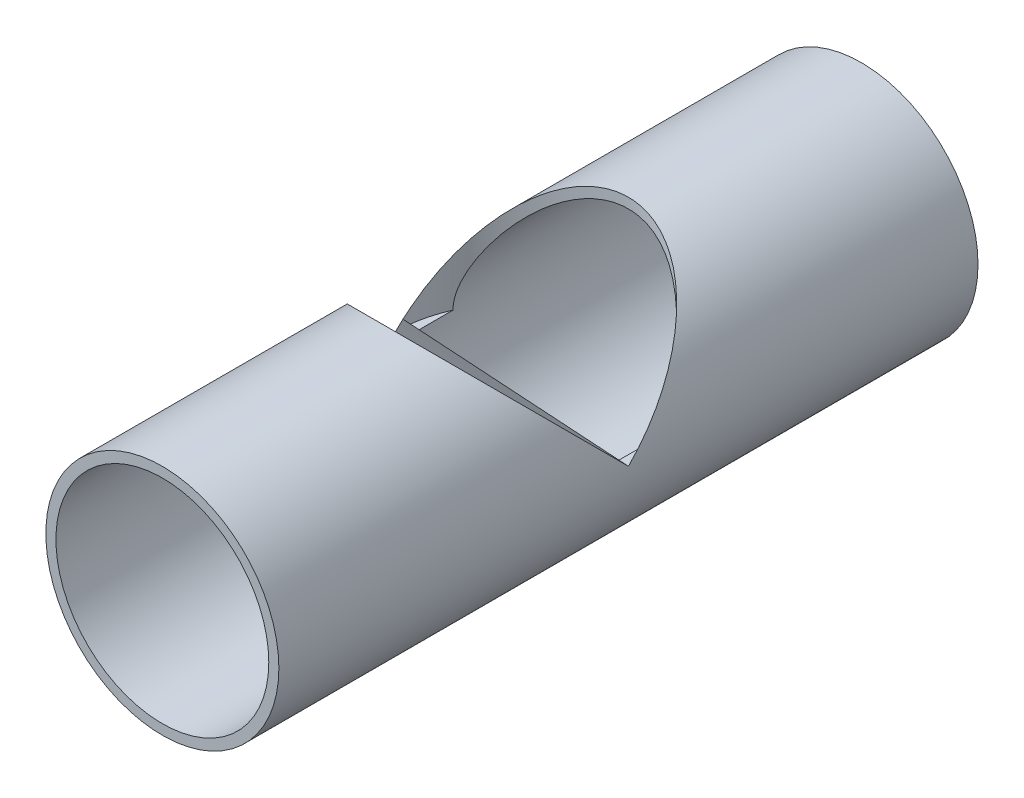
ISO-10303-21;
HEADER;
FILE_DESCRIPTION(('STEP AP214'),'2;1');
FILE_NAME('part.step','',(''),(''),'','','');
FILE_SCHEMA(('AUTOMOTIVE_DESIGN { 1 0 10303 214 1 1 1 1 }'));
ENDSEC;
DATA;
#1=APPLICATION_CONTEXT('core data for automotive mechanical design processes');
#2=APPLICATION_PROTOCOL_DEFINITION('international standard','automotive_design',2000,#1);
#3=PRODUCT_CONTEXT('',#1,'mechanical');
#4=PRODUCT('Part','Part','',(#3));
#5=PRODUCT_RELATED_PRODUCT_CATEGORY('part','',(#4));
#6=PRODUCT_DEFINITION_FORMATION('','',#4);
#7=PRODUCT_DEFINITION_CONTEXT('part definition',#1,'design');
#8=PRODUCT_DEFINITION('design','',#6,#7);
#9=PRODUCT_DEFINITION_SHAPE('','',#8);
#10=(LENGTH_UNIT() NAMED_UNIT(*) SI_UNIT(.MILLI.,.METRE.));
#11=(NAMED_UNIT(*) PLANE_ANGLE_UNIT() SI_UNIT($,.RADIAN.));
#12=(NAMED_UNIT(*) SI_UNIT($,.STERADIAN.) SOLID_ANGLE_UNIT());
#13=UNCERTAINTY_MEASURE_WITH_UNIT(LENGTH_MEASURE(1.E-05),#10,'distance_accuracy_value','');
#14=(GEOMETRIC_REPRESENTATION_CONTEXT(3) GLOBAL_UNCERTAINTY_ASSIGNED_CONTEXT((#13)) GLOBAL_UNIT_ASSIGNED_CONTEXT((#10,
#11,#12)) REPRESENTATION_CONTEXT('',''));
#15=CARTESIAN_POINT('',(0.,0.,0.));
#16=DIRECTION('',(0.,0.,1.));
#17=DIRECTION('',(1.,0.,0.));
#18=AXIS2_PLACEMENT_3D('',#15,#16,#17);
#19=CARTESIAN_POINT('',(0.,0.,57.15));
#20=DIRECTION('',(0.,-1.,0.));
#21=DIRECTION('',(0.,0.,-1.));
#22=AXIS2_PLACEMENT_3D('',#19,#20,#21);
#23=PLANE('',#22);
#24=CARTESIAN_POINT('',(0.,0.,57.15));
#25=DIRECTION('',(0.,1.,0.));
#26=DIRECTION('',(0.,0.,1.));
#27=AXIS2_PLACEMENT_3D('',#24,#25,#26);
#28=CIRCLE('',#27,19.05);
#29=CARTESIAN_POINT('',(-17.399,0.,49.3925971485297));
#30=VERTEX_POINT('',#29);
#31=CARTESIAN_POINT('',(-19.05,0.,57.15));
#32=VERTEX_POINT('',#31);
#33=EDGE_CURVE('E33',#30,#32,#28,.T.);
#34=ORIENTED_EDGE('',*,*,#33,.T.);
#35=CARTESIAN_POINT('',(0.,0.,57.15));
#36=DIRECTION('',(0.,1.,0.));
#37=DIRECTION('',(0.,0.,1.));
#38=AXIS2_PLACEMENT_3D('',#35,#36,#37);
#39=CIRCLE('',#38,19.05);
#40=CARTESIAN_POINT('',(-17.399,0.,64.9074028514703));
#41=VERTEX_POINT('',#40);
#42=EDGE_CURVE('E66',#32,#41,#39,.T.);
#43=ORIENTED_EDGE('',*,*,#42,.T.);
#44=DIRECTION('',(0.,0.,1.));
#45=VECTOR('',#44,1.);
#46=CARTESIAN_POINT('',(-17.399,0.,0.));
#47=LINE('',#46,#45);
#48=EDGE_CURVE('E58',#41,#30,#47,.F.);
#49=ORIENTED_EDGE('',*,*,#48,.T.);
#50=EDGE_LOOP('',(#34,#43,#49));
#51=FACE_BOUND('',#50,.T.);
#52=ADVANCED_FACE('F16',(#51),#23,.F.);
#53=CARTESIAN_POINT('',(0.,0.,57.15));
#54=DIRECTION('',(0.,-1.,0.));
#55=DIRECTION('',(0.,0.,-1.));
#56=AXIS2_PLACEMENT_3D('',#53,#54,#55);
#57=PLANE('',#56);
#58=CARTESIAN_POINT('',(0.,0.,57.15));
#59=DIRECTION('',(0.,1.,0.));
#60=DIRECTION('',(0.,0.,1.));
#61=AXIS2_PLACEMENT_3D('',#58,#59,#60);
#62=CIRCLE('',#61,19.05);
#63=CARTESIAN_POINT('',(17.399,0.,64.9074028514703));
#64=VERTEX_POINT('',#63);
#65=CARTESIAN_POINT('',(19.05,0.,57.15));
#66=VERTEX_POINT('',#65);
#67=EDGE_CURVE('E51',#64,#66,#62,.T.);
#68=ORIENTED_EDGE('',*,*,#67,.T.);
#69=CARTESIAN_POINT('',(0.,0.,57.15));
#70=DIRECTION('',(0.,1.,0.));
#71=DIRECTION('',(0.,0.,1.));
#72=AXIS2_PLACEMENT_3D('',#69,#70,#71);
#73=CIRCLE('',#72,19.05);
#74=CARTESIAN_POINT('',(17.399,0.,49.3925971485297));
#75=VERTEX_POINT('',#74);
#76=EDGE_CURVE('E54',#66,#75,#73,.T.);
#77=ORIENTED_EDGE('',*,*,#76,.T.);
#78=DIRECTION('',(0.,0.,1.));
#79=VECTOR('',#78,1.);
#80=CARTESIAN_POINT('',(17.399,0.,0.));
#81=LINE('',#80,#79);
#82=EDGE_CURVE('E47',#75,#64,#81,.T.);
#83=ORIENTED_EDGE('',*,*,#82,.T.);
#84=EDGE_LOOP('',(#68,#77,#83));
#85=FACE_BOUND('',#84,.T.);
#86=ADVANCED_FACE('F49',(#85),#57,.F.);
#87=CARTESIAN_POINT('',(0.,0.,0.));
#88=DIRECTION('',(0.,0.,1.));
#89=DIRECTION('',(1.,0.,0.));
#90=AXIS2_PLACEMENT_3D('',#87,#88,#89);
#91=CYLINDRICAL_SURFACE('',#90,17.399);
#92=CARTESIAN_POINT('',(0.,0.,0.));
#93=DIRECTION('',(0.,0.,1.));
#94=DIRECTION('',(1.,0.,0.));
#95=AXIS2_PLACEMENT_3D('',#92,#93,#94);
#96=CIRCLE('',#95,17.399);
#97=CARTESIAN_POINT('',(17.399,0.,0.));
#98=VERTEX_POINT('',#97);
#99=EDGE_CURVE('E118',#98,#98,#96,.T.);
#100=ORIENTED_EDGE('',*,*,#99,.F.);
#101=EDGE_LOOP('',(#100));
#102=FACE_BOUND('',#101,.T.);
#103=ORIENTED_EDGE('',*,*,#48,.F.);
#104=CARTESIAN_POINT('',(-17.399,0.,64.9074028514703));
#105=CARTESIAN_POINT('',(-17.3990027926557,0.126619411653412,64.9073892806763));
#106=CARTESIAN_POINT('',(-17.3976172953479,0.253213422142252,64.91050481767));
#107=CARTESIAN_POINT('',(-17.3920993093259,0.506011561056938,64.9228663106787));
#108=CARTESIAN_POINT('',(-17.3879674951789,0.632215777580591,64.9321107612707));
#109=CARTESIAN_POINT('',(-17.3715310393773,1.00902330778525,64.9687698671014));
#110=CARTESIAN_POINT('',(-17.3551849725285,1.25863541656879,65.005111937121));
#111=CARTESIAN_POINT('',(-17.3126787054344,1.74803233786395,65.0983443626753));
#112=CARTESIAN_POINT('',(-17.2867118539878,1.98791378893045,65.1548291232535));
#113=CARTESIAN_POINT('',(-17.2256220476168,2.4617617860572,65.2854561488629));
#114=CARTESIAN_POINT('',(-17.1904915826852,2.69572330712606,65.3596128925784));
#115=CARTESIAN_POINT('',(-17.0914704002142,3.27608545997221,65.5644416491115));
#116=CARTESIAN_POINT('',(-17.0220928683165,3.6182148201961,65.7045314532728));
#117=CARTESIAN_POINT('',(-16.8659507450822,4.2875618159471,66.008409139202));
#118=CARTESIAN_POINT('',(-16.7791763237468,4.6147708919803,66.1722104043654));
#119=CARTESIAN_POINT('',(-16.5885907607409,5.25908025866418,66.5180621575718));
#120=CARTESIAN_POINT('',(-16.4846028375362,5.57602990071133,66.7002934483331));
#121=CARTESIAN_POINT('',(-16.2611162606568,6.19761374754541,67.0760481170756));
#122=CARTESIAN_POINT('',(-16.1416117153161,6.50224321644266,67.2695757688457));
#123=CARTESIAN_POINT('',(-15.9012328343761,7.0682446326165,67.6427199440383));
#124=CARTESIAN_POINT('',(-15.7818795075659,7.33075234639333,67.8216028930283));
#125=CARTESIAN_POINT('',(-15.531375280231,7.84755054304734,68.1830066315397));
#126=CARTESIAN_POINT('',(-15.4002228366692,8.10183994524195,68.3655278944272));
#127=CARTESIAN_POINT('',(-15.1261173325553,8.60275103720113,68.7325543909568));
#128=CARTESIAN_POINT('',(-14.9831580377589,8.84936858024162,68.9170606274058));
#129=CARTESIAN_POINT('',(-14.6854749405307,9.33504840785214,69.2865419716062));
#130=CARTESIAN_POINT('',(-14.5307500246226,9.57410997430043,69.4715171221294));
#131=CARTESIAN_POINT('',(-14.0499414824725,10.2784757466186,70.023976753931));
#132=CARTESIAN_POINT('',(-13.706221982577,10.7327911450247,70.3903569500405));
#133=CARTESIAN_POINT('',(-12.9709988366539,11.6105902831832,71.1114056628348));
#134=CARTESIAN_POINT('',(-12.5795204493307,12.0340901330639,71.4660802453506));
#135=CARTESIAN_POINT('',(-11.8513027830295,12.7460780346226,72.0702493412787));
#136=CARTESIAN_POINT('',(-11.5252152004648,13.0419213680792,72.32393857843));
#137=CARTESIAN_POINT('',(-10.8451357651757,13.6126880208168,72.8172254345686));
#138=CARTESIAN_POINT('',(-10.4911442114866,13.8876115642246,73.0568232045201));
#139=CARTESIAN_POINT('',(-9.7556464324253,14.4137713143204,73.5182053590736));
#140=CARTESIAN_POINT('',(-9.37416774185507,14.6650306596365,73.7400071123435));
#141=CARTESIAN_POINT('',(-8.58390774378864,15.1411487148883,74.1623369264844));
#142=CARTESIAN_POINT('',(-8.17513251731963,15.3660132743823,74.3628696999896));
#143=CARTESIAN_POINT('',(-7.41609675759786,15.7438449488538,74.7010787980119));
#144=CARTESIAN_POINT('',(-7.07052907343838,15.9021892450143,74.8432976749746));
#145=CARTESIAN_POINT('',(-6.36382451687045,16.1979501260028,75.1095864108884));
#146=CARTESIAN_POINT('',(-6.00269106933714,16.3353712846128,75.2336602360993));
#147=CARTESIAN_POINT('',(-5.26647789377184,16.5873660705375,75.4616118596446));
#148=CARTESIAN_POINT('',(-4.89140366751787,16.7019485999545,75.5654975265765));
#149=CARTESIAN_POINT('',(-4.12923028647436,16.9065171053999,75.751230625274));
#150=CARTESIAN_POINT('',(-3.74213100127715,16.9965028145804,75.8330778179467));
#151=CARTESIAN_POINT('',(-2.95593537190508,17.1507769807365,75.9735337773239));
#152=CARTESIAN_POINT('',(-2.55677683000924,17.2148923872178,76.0319860313285));
#153=CARTESIAN_POINT('',(-1.75207798329658,17.3153056168189,76.1235785556383));
#154=CARTESIAN_POINT('',(-1.34653766138736,17.3516033654214,76.1567187581382));
#155=CARTESIAN_POINT('',(-0.532740871466237,17.3956140232931,76.1969054092446));
#156=CARTESIAN_POINT('',(-0.124485289769641,17.4033358417348,76.2039599906146));
#157=CARTESIAN_POINT('',(0.691145635542898,17.3900500247943,76.1918258138202));
#158=CARTESIAN_POINT('',(1.09852104488591,17.3690446145166,76.17263908821));
#159=CARTESIAN_POINT('',(1.86650740664488,17.3024305274246,76.1118364386318));
#160=CARTESIAN_POINT('',(2.22756908470294,17.2596128163397,76.0727652631555));
#161=CARTESIAN_POINT('',(2.94361664813322,17.1520079260685,75.9746695916722));
#162=CARTESIAN_POINT('',(3.2986030444039,17.0872226038712,75.9156467822389));
#163=CARTESIAN_POINT('',(4.00038341779028,16.9366748894927,75.7786682489914));
#164=CARTESIAN_POINT('',(4.34717668373007,16.8509106835957,75.700710888207));
#165=CARTESIAN_POINT('',(5.03073264287059,16.65961931318,75.5271216594109));
#166=CARTESIAN_POINT('',(5.36749474073483,16.5540909783843,75.4314887447959));
#167=CARTESIAN_POINT('',(6.04508836894759,16.319211609248,75.2190712727942));
#168=CARTESIAN_POINT('',(6.38536566225002,16.1889732182397,75.1015031398445));
#169=CARTESIAN_POINT('',(7.05200979717744,15.9099012910429,74.8502421296737));
#170=CARTESIAN_POINT('',(7.37837661185775,15.7610677188377,74.7165492212207));
#171=CARTESIAN_POINT('',(8.01637955747604,15.4463398391999,74.4347274052077));
#172=CARTESIAN_POINT('',(8.32801263159099,15.2804420139058,74.2865955213283));
#173=CARTESIAN_POINT('',(8.93593865373799,14.9330779736276,73.9775912941988));
#174=CARTESIAN_POINT('',(9.23222831724047,14.751608447154,73.8167162415391));
#175=CARTESIAN_POINT('',(9.96108070114769,14.2751141336036,73.39616265681));
#176=CARTESIAN_POINT('',(10.3832304302346,13.9706188807904,73.1290705087056));
#177=CARTESIAN_POINT('',(11.1906483352997,13.3326512383542,72.5743967388524));
#178=CARTESIAN_POINT('',(11.5758996118658,12.9991657033674,72.2868058328948));
#179=CARTESIAN_POINT('',(12.3107246973626,12.3055766392129,71.6954983316236));
#180=CARTESIAN_POINT('',(12.6601983724747,11.9454030182208,71.3917399093147));
#181=CARTESIAN_POINT('',(13.3228256699068,11.2015895641249,70.7738744147983));
#182=CARTESIAN_POINT('',(13.6359864105728,10.8179543527437,70.4597693863683));
#183=CARTESIAN_POINT('',(14.2338486111263,10.0188698517803,69.8187294700677));
#184=CARTESIAN_POINT('',(14.517686463156,9.60287793519724,69.4916676006417));
#185=CARTESIAN_POINT('',(15.0487827113267,8.74718214020968,68.838186754623));
#186=CARTESIAN_POINT('',(15.296023432836,8.30746694358544,68.5117681633014));
#187=CARTESIAN_POINT('',(15.6391176739874,7.6293606590487,68.0293160856903));
#188=CARTESIAN_POINT('',(15.7488029782035,7.40036468575161,67.869778727444));
#189=CARTESIAN_POINT('',(15.9589029321096,6.9356804418858,67.5544108647403));
#190=CARTESIAN_POINT('',(16.0593187405627,6.69999301263363,67.3985798987662));
#191=CARTESIAN_POINT('',(16.25064002581,6.22159236078595,67.0924221698046));
#192=CARTESIAN_POINT('',(16.3415534376162,5.97888521981352,66.9420908835962));
#193=CARTESIAN_POINT('',(16.5136633013956,5.48564865833397,66.6489623035712));
#194=CARTESIAN_POINT('',(16.5948621460068,5.23512118317328,66.5061631594989));
#195=CARTESIAN_POINT('',(16.7399044598348,4.74960595279282,66.2438654480011));
#196=CARTESIAN_POINT('',(16.8046633839798,4.51539494834859,66.1234411407302));
#197=CARTESIAN_POINT('',(16.9253972886873,4.03935876063698,65.8935847674936));
#198=CARTESIAN_POINT('',(16.981371807116,3.79753317758156,65.784153279952));
#199=CARTESIAN_POINT('',(17.0835577011958,3.30749209621931,65.5801538563993));
#200=CARTESIAN_POINT('',(17.1298288043977,3.05932691299981,65.4854959663158));
#201=CARTESIAN_POINT('',(17.2122316312634,2.55526916443492,65.3139853899444));
#202=CARTESIAN_POINT('',(17.2483680118588,2.29938020825195,65.2371245287159));
#203=CARTESIAN_POINT('',(17.2984619179857,1.87510757973664,65.1292141352051));
#204=CARTESIAN_POINT('',(17.3157056836072,1.70875077851934,65.0916704239793));
#205=CARTESIAN_POINT('',(17.3454986249527,1.37373521286453,65.0263862190104));
#206=CARTESIAN_POINT('',(17.35804919276,1.20507714643118,64.9986428184619));
#207=CARTESIAN_POINT('',(17.3783689967595,0.86423619591593,64.9535535854909));
#208=CARTESIAN_POINT('',(17.386085725966,0.692034904492633,64.9363219871161));
#209=CARTESIAN_POINT('',(17.3964114605965,0.34656692612635,64.9132082062703));
#210=CARTESIAN_POINT('',(17.3990157927525,0.173299409508221,64.9073364079205));
#211=CARTESIAN_POINT('',(17.399,0.,64.9074028514704));
#212=B_SPLINE_CURVE_WITH_KNOTS('',3,(#104,#105,#106,#107,#108,#109,#110,#111,#112,#113,#114,
#115,#116,#117,#118,#119,#120,#121,#122,#123,#124,#125,#126,#127,#128,#129,#130,#131,#132,#133,
#134,#135,#136,#137,#138,#139,#140,#141,#142,#143,#144,#145,#146,#147,#148,#149,#150,#151,#152,
#153,#154,#155,#156,#157,#158,#159,#160,#161,#162,#163,#164,#165,#166,#167,#168,#169,#170,#171,
#172,#173,#174,#175,#176,#177,#178,#179,#180,#181,#182,#183,#184,#185,#186,#187,#188,#189,#190,
#191,#192,#193,#194,#195,#196,#197,#198,#199,#200,#201,#202,#203,#204,#205,#206,#207,#208,#209,
#210,#211),.UNSPECIFIED.,.F.,.F.,(4,2,2,2,2,2,2,2,2,2,2,2,2,2,2,2,2,2,2,2,2,2,2,2,2,2,2,2,2,2,2,
2,2,2,2,2,2,2,2,2,2,2,2,2,2,2,2,2,2,2,2,2,2,4),(0.,0.379764092853833,0.759434940165909,
1.51634726991587,2.25880724087371,3.00187761458816,4.12835037763912,5.25546144985719,
6.3949616034871,7.53489569789875,8.55259337985784,9.57042434587642,10.5887962249633,
11.6072646010801,13.6367495933949,15.6651658480776,17.1883664070907,18.71155064481,
20.2332297195439,21.754570923617,22.9709961355442,24.187155054878,25.4028390055058,
26.6185361444175,27.8422355786928,29.0659382909752,30.2892594549617,31.5124858703965,
32.608284333679,33.7039901888642,34.7997908060849,35.8956563285599,37.043090764153,
38.1905274222329,39.3382011047017,40.4861194600479,42.2386035757021,43.991886525206,
45.749949583538,47.5076674278728,49.3075787665061,51.1083565581974,52.0077767250255,
52.9070843042516,53.8056348105301,54.7039635517724,55.5171752742101,56.3304297641096,
57.1385211097759,57.9462405247013,58.4601584642904,58.9739238458356,59.4931773421597,
60.0129052701034),.UNSPECIFIED.);
#213=EDGE_CURVE('E62',#41,#64,#212,.T.);
#214=ORIENTED_EDGE('',*,*,#213,.T.);
#215=ORIENTED_EDGE('',*,*,#82,.F.);
#216=CARTESIAN_POINT('',(17.399,0.,49.3925971485297));
#217=CARTESIAN_POINT('',(17.3990027926557,0.12661941165341,49.3926107193237));
#218=CARTESIAN_POINT('',(17.3976172953479,0.25321342214225,49.38949518233));
#219=CARTESIAN_POINT('',(17.3920993093259,0.506011561056936,49.3771336893213));
#220=CARTESIAN_POINT('',(17.3879674951789,0.632215777580588,49.3678892387293));
#221=CARTESIAN_POINT('',(17.3715310393773,1.00902330778525,49.3312301328986));
#222=CARTESIAN_POINT('',(17.3551849725285,1.25863541656879,49.294888062879));
#223=CARTESIAN_POINT('',(17.3126787054344,1.74803233786395,49.2016556373247));
#224=CARTESIAN_POINT('',(17.2867118539878,1.98791378893046,49.1451708767465));
#225=CARTESIAN_POINT('',(17.2256220476168,2.4617617860572,49.0145438511371));
#226=CARTESIAN_POINT('',(17.1904915826852,2.69572330712607,48.9403871074216));
#227=CARTESIAN_POINT('',(17.0914704002142,3.2760854599722,48.7355583508885));
#228=CARTESIAN_POINT('',(17.0220928683165,3.6182148201961,48.5954685467272));
#229=CARTESIAN_POINT('',(16.8659507450822,4.28756181594711,48.291590860798));
#230=CARTESIAN_POINT('',(16.7791763237468,4.6147708919803,48.1277895956346));
#231=CARTESIAN_POINT('',(16.5885907607409,5.25908025866418,47.7819378424282));
#232=CARTESIAN_POINT('',(16.4846028375362,5.57602990071133,47.5997065516669));
#233=CARTESIAN_POINT('',(16.2611162606568,6.19761374754541,47.2239518829244));
#234=CARTESIAN_POINT('',(16.1416117153161,6.50224321644265,47.0304242311543));
#235=CARTESIAN_POINT('',(15.9012328343761,7.06824463261649,46.6572800559617));
#236=CARTESIAN_POINT('',(15.7818795075659,7.33075234639333,46.4783971069717));
#237=CARTESIAN_POINT('',(15.531375280231,7.84755054304734,46.1169933684603));
#238=CARTESIAN_POINT('',(15.4002228366692,8.10183994524193,45.9344721055728));
#239=CARTESIAN_POINT('',(15.1261173325553,8.60275103720112,45.5674456090432));
#240=CARTESIAN_POINT('',(14.9831580377589,8.84936858024161,45.3829393725942));
#241=CARTESIAN_POINT('',(14.6854749405307,9.33504840785213,45.0134580283939));
#242=CARTESIAN_POINT('',(14.5307500246226,9.57410997430042,44.8284828778707));
#243=CARTESIAN_POINT('',(14.0499414824725,10.2784757466186,44.276023246069));
#244=CARTESIAN_POINT('',(13.706221982577,10.7327911450247,43.9096430499595));
#245=CARTESIAN_POINT('',(12.9709988366539,11.6105902831832,43.1885943371652));
#246=CARTESIAN_POINT('',(12.5795204493307,12.0340901330639,42.8339197546494));
#247=CARTESIAN_POINT('',(11.8513027830295,12.7460780346226,42.2297506587214));
#248=CARTESIAN_POINT('',(11.5252152004648,13.0419213680792,41.97606142157));
#249=CARTESIAN_POINT('',(10.8451357651757,13.6126880208168,41.4827745654314));
#250=CARTESIAN_POINT('',(10.4911442114866,13.8876115642246,41.2431767954799));
#251=CARTESIAN_POINT('',(9.7556464324253,14.4137713143204,40.7817946409264));
#252=CARTESIAN_POINT('',(9.37416774185507,14.6650306596365,40.5599928876565));
#253=CARTESIAN_POINT('',(8.58390774378864,15.1411487148883,40.1376630735156));
#254=CARTESIAN_POINT('',(8.17513251731962,15.3660132743823,39.9371303000104));
#255=CARTESIAN_POINT('',(7.41609675759786,15.7438449488538,39.5989212019881));
#256=CARTESIAN_POINT('',(7.07052907343837,15.9021892450143,39.4567023250254));
#257=CARTESIAN_POINT('',(6.36382451687044,16.1979501260028,39.1904135891116));
#258=CARTESIAN_POINT('',(6.00269106933713,16.3353712846128,39.0663397639007));
#259=CARTESIAN_POINT('',(5.26647789377183,16.5873660705375,38.8383881403555));
#260=CARTESIAN_POINT('',(4.89140366751786,16.7019485999545,38.7345024734235));
#261=CARTESIAN_POINT('',(4.12923028647435,16.9065171053999,38.548769374726));
#262=CARTESIAN_POINT('',(3.74213100127715,16.9965028145804,38.4669221820533));
#263=CARTESIAN_POINT('',(2.95593537190507,17.1507769807365,38.3264662226761));
#264=CARTESIAN_POINT('',(2.55677683000923,17.2148923872178,38.2680139686715));
#265=CARTESIAN_POINT('',(1.75207798329657,17.3153056168189,38.1764214443617));
#266=CARTESIAN_POINT('',(1.34653766138735,17.3516033654214,38.1432812418618));
#267=CARTESIAN_POINT('',(0.532740871466227,17.3956140232931,38.1030945907555));
#268=CARTESIAN_POINT('',(0.124485289769633,17.4033358417348,38.0960400093854));
#269=CARTESIAN_POINT('',(-0.691145635542906,17.3900500247943,38.1081741861798));
#270=CARTESIAN_POINT('',(-1.09852104488592,17.3690446145166,38.12736091179));
#271=CARTESIAN_POINT('',(-1.86650740664489,17.3024305274246,38.1881635613682));
#272=CARTESIAN_POINT('',(-2.22756908470294,17.2596128163397,38.2272347368446));
#273=CARTESIAN_POINT('',(-2.94361664813322,17.1520079260685,38.3253304083278));
#274=CARTESIAN_POINT('',(-3.2986030444039,17.0872226038712,38.3843532177611));
#275=CARTESIAN_POINT('',(-4.00038341779028,16.9366748894927,38.5213317510087));
#276=CARTESIAN_POINT('',(-4.34717668373008,16.8509106835957,38.5992891117931));
#277=CARTESIAN_POINT('',(-5.0307326428706,16.65961931318,38.7728783405891));
#278=CARTESIAN_POINT('',(-5.36749474073484,16.5540909783843,38.8685112552042));
#279=CARTESIAN_POINT('',(-6.04508836894759,16.319211609248,39.0809287272059));
#280=CARTESIAN_POINT('',(-6.38536566225003,16.1889732182396,39.1984968601555));
#281=CARTESIAN_POINT('',(-7.05200979717745,15.9099012910429,39.4497578703263));
#282=CARTESIAN_POINT('',(-7.37837661185776,15.7610677188377,39.5834507787793));
#283=CARTESIAN_POINT('',(-8.01637955747605,15.4463398391999,39.8652725947923));
#284=CARTESIAN_POINT('',(-8.32801263159099,15.2804420139058,40.0134044786717));
#285=CARTESIAN_POINT('',(-8.93593865373799,14.9330779736276,40.3224087058013));
#286=CARTESIAN_POINT('',(-9.23222831724047,14.751608447154,40.4832837584609));
#287=CARTESIAN_POINT('',(-9.9610807011477,14.2751141336036,40.90383734319));
#288=CARTESIAN_POINT('',(-10.3832304302346,13.9706188807904,41.1709294912944));
#289=CARTESIAN_POINT('',(-11.1906483352997,13.3326512383542,41.7256032611476));
#290=CARTESIAN_POINT('',(-11.5758996118658,12.9991657033674,42.0131941671052));
#291=CARTESIAN_POINT('',(-12.3107246973626,12.3055766392129,42.6045016683764));
#292=CARTESIAN_POINT('',(-12.6601983724747,11.9454030182208,42.9082600906854));
#293=CARTESIAN_POINT('',(-13.3228256699068,11.2015895641249,43.5261255852017));
#294=CARTESIAN_POINT('',(-13.6359864105728,10.8179543527437,43.8402306136318));
#295=CARTESIAN_POINT('',(-14.2338486111263,10.0188698517803,44.4812705299324));
#296=CARTESIAN_POINT('',(-14.517686463156,9.60287793519723,44.8083323993583));
#297=CARTESIAN_POINT('',(-15.0487827113267,8.74718214020968,45.461813245377));
#298=CARTESIAN_POINT('',(-15.296023432836,8.30746694358544,45.7882318366987));
#299=CARTESIAN_POINT('',(-15.6391176739874,7.6293606590487,46.2706839143097));
#300=CARTESIAN_POINT('',(-15.7488029782035,7.40036468575161,46.430221272556));
#301=CARTESIAN_POINT('',(-15.9589029321096,6.93568044188581,46.7455891352597));
#302=CARTESIAN_POINT('',(-16.0593187405627,6.69999301263364,46.9014201012338));
#303=CARTESIAN_POINT('',(-16.25064002581,6.22159236078596,47.2075778301954));
#304=CARTESIAN_POINT('',(-16.3415534376162,5.97888521981353,47.3579091164038));
#305=CARTESIAN_POINT('',(-16.5136633013956,5.48564865833398,47.6510376964288));
#306=CARTESIAN_POINT('',(-16.5948621460068,5.23512118317328,47.7938368405011));
#307=CARTESIAN_POINT('',(-16.7399044598348,4.74960595279281,48.0561345519989));
#308=CARTESIAN_POINT('',(-16.8046633839798,4.51539494834858,48.1765588592699));
#309=CARTESIAN_POINT('',(-16.9253972886873,4.03935876063698,48.4064152325064));
#310=CARTESIAN_POINT('',(-16.981371807116,3.79753317758156,48.515846720048));
#311=CARTESIAN_POINT('',(-17.0835577011958,3.30749209621931,48.7198461436007));
#312=CARTESIAN_POINT('',(-17.1298288043977,3.05932691299981,48.8145040336842));
#313=CARTESIAN_POINT('',(-17.2122316312634,2.55526916443492,48.9860146100556));
#314=CARTESIAN_POINT('',(-17.2483680118588,2.29938020825194,49.0628754712841));
#315=CARTESIAN_POINT('',(-17.2984619179858,1.87510757973663,49.1707858647949));
#316=CARTESIAN_POINT('',(-17.3157056836072,1.70875077851933,49.2083295760207));
#317=CARTESIAN_POINT('',(-17.3454986249527,1.37373521286453,49.2736137809896));
#318=CARTESIAN_POINT('',(-17.35804919276,1.20507714643118,49.3013571815381));
#319=CARTESIAN_POINT('',(-17.3783689967595,0.864236195915931,49.3464464145092));
#320=CARTESIAN_POINT('',(-17.386085725966,0.692034904492635,49.3636780128839));
#321=CARTESIAN_POINT('',(-17.3964114605965,0.346566926126353,49.3867917937297));
#322=CARTESIAN_POINT('',(-17.3990157927525,0.173299409508221,49.3926635920795));
#323=CARTESIAN_POINT('',(-17.399,0.,49.3925971485297));
#324=B_SPLINE_CURVE_WITH_KNOTS('',3,(#216,#217,#218,#219,#220,#221,#222,#223,#224,#225,#226,
#227,#228,#229,#230,#231,#232,#233,#234,#235,#236,#237,#238,#239,#240,#241,#242,#243,#244,#245,
#246,#247,#248,#249,#250,#251,#252,#253,#254,#255,#256,#257,#258,#259,#260,#261,#262,#263,#264,
#265,#266,#267,#268,#269,#270,#271,#272,#273,#274,#275,#276,#277,#278,#279,#280,#281,#282,#283,
#284,#285,#286,#287,#288,#289,#290,#291,#292,#293,#294,#295,#296,#297,#298,#299,#300,#301,#302,
#303,#304,#305,#306,#307,#308,#309,#310,#311,#312,#313,#314,#315,#316,#317,#318,#319,#320,#321,
#322,#323),.UNSPECIFIED.,.F.,.F.,(4,2,2,2,2,2,2,2,2,2,2,2,2,2,2,2,2,2,2,2,2,2,2,2,2,2,2,2,2,2,2,
2,2,2,2,2,2,2,2,2,2,2,2,2,2,2,2,2,2,2,2,2,2,4),(0.,0.379764092853832,0.759434940165908,
1.51634726991587,2.25880724087371,3.00187761458816,4.12835037763912,5.25546144985719,
6.39496160348711,7.53489569789875,8.55259337985783,9.57042434587641,10.5887962249633,
11.6072646010801,13.6367495933949,15.6651658480776,17.1883664070907,18.71155064481,
20.2332297195439,21.754570923617,22.9709961355442,24.187155054878,25.4028390055058,
26.6185361444175,27.8422355786928,29.0659382909752,30.2892594549617,31.5124858703965,
32.608284333679,33.7039901888642,34.7997908060849,35.8956563285599,37.043090764153,
38.1905274222329,39.3382011047017,40.4861194600479,42.2386035757021,43.991886525206,
45.749949583538,47.5076674278728,49.3075787665061,51.1083565581975,52.0077767250255,
52.9070843042516,53.8056348105302,54.7039635517725,55.5171752742101,56.3304297641096,
57.1385211097759,57.9462405247014,58.4601584642904,58.9739238458356,59.4931773421598,
60.0129052701035),.UNSPECIFIED.);
#325=EDGE_CURVE('E122',#75,#30,#324,.T.);
#326=ORIENTED_EDGE('',*,*,#325,.T.);
#327=EDGE_LOOP('',(#103,#214,#215,#326));
#328=FACE_BOUND('',#327,.T.);
#329=CARTESIAN_POINT('',(0.,0.,114.3));
#330=DIRECTION('',(0.,0.,1.));
#331=DIRECTION('',(1.,0.,0.));
#332=AXIS2_PLACEMENT_3D('',#329,#330,#331);
#333=CIRCLE('',#332,17.399);
#334=CARTESIAN_POINT('',(17.399,0.,114.3));
#335=VERTEX_POINT('',#334);
#336=EDGE_CURVE('E19',#335,#335,#333,.T.);
#337=ORIENTED_EDGE('',*,*,#336,.T.);
#338=EDGE_LOOP('',(#337));
#339=FACE_BOUND('',#338,.T.);
#340=ADVANCED_FACE('F63',(#102,#328,#339),#91,.F.);
#341=CARTESIAN_POINT('',(0.,0.,114.3));
#342=DIRECTION('',(0.,0.,-1.));
#343=DIRECTION('',(-1.,0.,0.));
#344=AXIS2_PLACEMENT_3D('',#341,#342,#343);
#345=PLANE('',#344);
#346=ORIENTED_EDGE('',*,*,#336,.F.);
#347=EDGE_LOOP('',(#346));
#348=FACE_BOUND('',#347,.T.);
#349=CARTESIAN_POINT('',(0.,0.,114.3));
#350=DIRECTION('',(0.,0.,1.));
#351=DIRECTION('',(1.,0.,0.));
#352=AXIS2_PLACEMENT_3D('',#349,#350,#351);
#353=CIRCLE('',#352,19.05);
#354=CARTESIAN_POINT('',(19.05,0.,114.3));
#355=VERTEX_POINT('',#354);
#356=EDGE_CURVE('E117',#355,#355,#353,.F.);
#357=ORIENTED_EDGE('',*,*,#356,.F.);
#358=EDGE_LOOP('',(#357));
#359=FACE_BOUND('',#358,.T.);
#360=ADVANCED_FACE('F87',(#348,#359),#345,.F.);
#361=CARTESIAN_POINT('',(0.,0.,57.15));
#362=DIRECTION('',(0.,1.,0.));
#363=DIRECTION('',(0.,0.,1.));
#364=AXIS2_PLACEMENT_3D('',#361,#362,#363);
#365=CYLINDRICAL_SURFACE('',#364,19.05);
#366=ORIENTED_EDGE('',*,*,#42,.F.);
#367=CARTESIAN_POINT('',(0.,0.,57.15));
#368=DIRECTION('',(0.,-0.707106781186547,0.707106781186547));
#369=DIRECTION('',(0.,0.707106781186547,0.707106781186547));
#370=AXIS2_PLACEMENT_3D('',#367,#368,#369);
#371=ELLIPSE('',#370,26.9407683632075,19.05);
#372=EDGE_CURVE('E70',#66,#32,#371,.T.);
#373=ORIENTED_EDGE('',*,*,#372,.F.);
#374=ORIENTED_EDGE('',*,*,#67,.F.);
#375=ORIENTED_EDGE('',*,*,#213,.F.);
#376=EDGE_LOOP('',(#366,#373,#374,#375));
#377=FACE_BOUND('',#376,.T.);
#378=ADVANCED_FACE('F68',(#377),#365,.F.);
#379=CARTESIAN_POINT('',(0.,0.,57.15));
#380=DIRECTION('',(0.,1.,0.));
#381=DIRECTION('',(0.,0.,1.));
#382=AXIS2_PLACEMENT_3D('',#379,#380,#381);
#383=CYLINDRICAL_SURFACE('',#382,19.05);
#384=ORIENTED_EDGE('',*,*,#76,.F.);
#385=CARTESIAN_POINT('',(0.,0.,57.15));
#386=DIRECTION('',(0.,0.707106781186547,0.707106781186547));
#387=DIRECTION('',(0.,0.707106781186547,-0.707106781186547));
#388=AXIS2_PLACEMENT_3D('',#385,#386,#387);
#389=ELLIPSE('',#388,26.9407683632075,19.05);
#390=EDGE_CURVE('E25',#32,#66,#389,.F.);
#391=ORIENTED_EDGE('',*,*,#390,.F.);
#392=ORIENTED_EDGE('',*,*,#33,.F.);
#393=ORIENTED_EDGE('',*,*,#325,.F.);
#394=EDGE_LOOP('',(#384,#391,#392,#393));
#395=FACE_BOUND('',#394,.T.);
#396=ADVANCED_FACE('F86',(#395),#383,.F.);
#397=CARTESIAN_POINT('',(0.,0.,0.));
#398=DIRECTION('',(0.,0.,-1.));
#399=DIRECTION('',(-1.,0.,0.));
#400=AXIS2_PLACEMENT_3D('',#397,#398,#399);
#401=PLANE('',#400);
#402=ORIENTED_EDGE('',*,*,#99,.T.);
#403=EDGE_LOOP('',(#402));
#404=FACE_BOUND('',#403,.T.);
#405=CARTESIAN_POINT('',(0.,0.,0.));
#406=DIRECTION('',(0.,0.,1.));
#407=DIRECTION('',(1.,0.,0.));
#408=AXIS2_PLACEMENT_3D('',#405,#406,#407);
#409=CIRCLE('',#408,19.05);
#410=CARTESIAN_POINT('',(19.05,0.,0.));
#411=VERTEX_POINT('',#410);
#412=EDGE_CURVE('E11',#411,#411,#409,.T.);
#413=ORIENTED_EDGE('',*,*,#412,.F.);
#414=EDGE_LOOP('',(#413));
#415=FACE_BOUND('',#414,.T.);
#416=ADVANCED_FACE('F102',(#404,#415),#401,.T.);
#417=CARTESIAN_POINT('',(0.,0.,0.));
#418=DIRECTION('',(0.,0.,1.));
#419=DIRECTION('',(1.,0.,0.));
#420=AXIS2_PLACEMENT_3D('',#417,#418,#419);
#421=CYLINDRICAL_SURFACE('',#420,19.05);
#422=ORIENTED_EDGE('',*,*,#412,.T.);
#423=EDGE_LOOP('',(#422));
#424=FACE_BOUND('',#423,.T.);
#425=ORIENTED_EDGE('',*,*,#372,.T.);
#426=ORIENTED_EDGE('',*,*,#390,.T.);
#427=EDGE_LOOP('',(#425,#426));
#428=FACE_BOUND('',#427,.T.);
#429=ORIENTED_EDGE('',*,*,#356,.T.);
#430=EDGE_LOOP('',(#429));
#431=FACE_BOUND('',#430,.T.);
#432=ADVANCED_FACE('F100',(#424,#428,#431),#421,.T.);
#433=CLOSED_SHELL('',(#52,#86,#340,#360,#378,#396,#416,#432));
#434=MANIFOLD_SOLID_BREP('B1',#433);
#435=ADVANCED_BREP_SHAPE_REPRESENTATION('',(#18,#434),#14);
#436=SHAPE_DEFINITION_REPRESENTATION(#9,#435);
ENDSEC;
END-ISO-10303-21;
